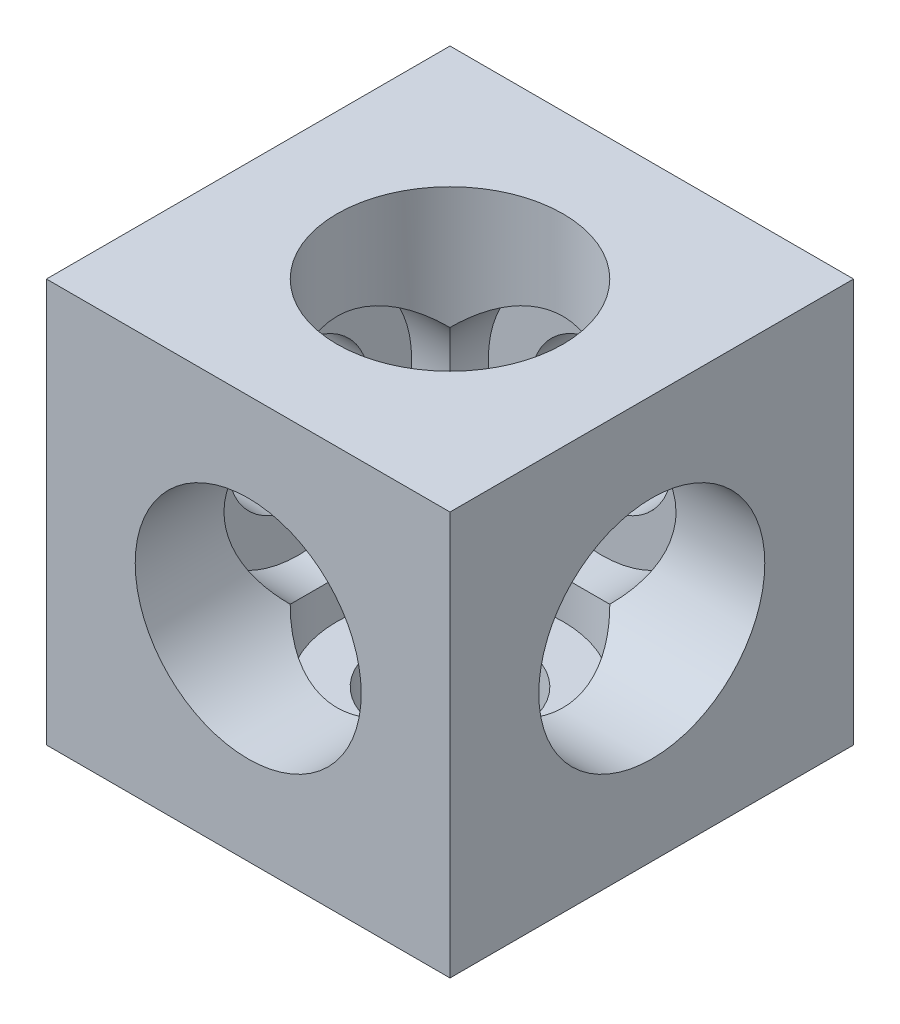
ISO-10303-21;
HEADER;
FILE_DESCRIPTION(('STEP AP214'),'2;1');
FILE_NAME('part.step','',(''),(''),'','','');
FILE_SCHEMA(('AUTOMOTIVE_DESIGN { 1 0 10303 214 1 1 1 1 }'));
ENDSEC;
DATA;
#1=APPLICATION_CONTEXT('core data for automotive mechanical design processes');
#2=APPLICATION_PROTOCOL_DEFINITION('international standard','automotive_design',2000,#1);
#3=PRODUCT_CONTEXT('',#1,'mechanical');
#4=PRODUCT('Part','Part','',(#3));
#5=PRODUCT_RELATED_PRODUCT_CATEGORY('part','',(#4));
#6=PRODUCT_DEFINITION_FORMATION('','',#4);
#7=PRODUCT_DEFINITION_CONTEXT('part definition',#1,'design');
#8=PRODUCT_DEFINITION('design','',#6,#7);
#9=PRODUCT_DEFINITION_SHAPE('','',#8);
#10=(LENGTH_UNIT() NAMED_UNIT(*) SI_UNIT(.MILLI.,.METRE.));
#11=(NAMED_UNIT(*) PLANE_ANGLE_UNIT() SI_UNIT($,.RADIAN.));
#12=(NAMED_UNIT(*) SI_UNIT($,.STERADIAN.) SOLID_ANGLE_UNIT());
#13=UNCERTAINTY_MEASURE_WITH_UNIT(LENGTH_MEASURE(1.E-05),#10,'distance_accuracy_value','');
#14=(GEOMETRIC_REPRESENTATION_CONTEXT(3) GLOBAL_UNCERTAINTY_ASSIGNED_CONTEXT((#13)) GLOBAL_UNIT_ASSIGNED_CONTEXT((#10,
#11,#12)) REPRESENTATION_CONTEXT('',''));
#15=CARTESIAN_POINT('',(0.,0.,0.));
#16=DIRECTION('',(0.,0.,1.));
#17=DIRECTION('',(1.,0.,0.));
#18=AXIS2_PLACEMENT_3D('',#15,#16,#17);
#19=CARTESIAN_POINT('',(-10.,0.,0.));
#20=DIRECTION('',(1.,0.,0.));
#21=DIRECTION('',(0.,0.,-1.));
#22=AXIS2_PLACEMENT_3D('',#19,#20,#21);
#23=CYLINDRICAL_SURFACE('',#22,3.5);
#24=CARTESIAN_POINT('',(-10.,0.,0.));
#25=DIRECTION('',(1.,0.,0.));
#26=DIRECTION('',(0.,0.,-1.));
#27=AXIS2_PLACEMENT_3D('',#24,#25,#26);
#28=CIRCLE('',#27,3.5);
#29=CARTESIAN_POINT('',(-10.,0.,-3.5));
#30=VERTEX_POINT('',#29);
#31=EDGE_CURVE('E146',#30,#30,#28,.T.);
#32=ORIENTED_EDGE('',*,*,#31,.F.);
#33=EDGE_LOOP('',(#32));
#34=FACE_BOUND('',#33,.T.);
#35=CARTESIAN_POINT('',(-7.5,0.,0.));
#36=DIRECTION('',(1.,0.,0.));
#37=DIRECTION('',(0.,0.,-1.));
#38=AXIS2_PLACEMENT_3D('',#35,#36,#37);
#39=CIRCLE('',#38,3.5);
#40=CARTESIAN_POINT('',(-7.5,0.,-3.5));
#41=VERTEX_POINT('',#40);
#42=EDGE_CURVE('E39',#41,#41,#39,.F.);
#43=ORIENTED_EDGE('',*,*,#42,.F.);
#44=EDGE_LOOP('',(#43));
#45=FACE_BOUND('',#44,.T.);
#46=ADVANCED_FACE('F35',(#34,#45),#23,.F.);
#47=CARTESIAN_POINT('',(0.,0.,-10.));
#48=DIRECTION('',(0.,0.,1.));
#49=DIRECTION('',(1.,0.,0.));
#50=AXIS2_PLACEMENT_3D('',#47,#48,#49);
#51=CYLINDRICAL_SURFACE('',#50,3.5);
#52=CARTESIAN_POINT('',(0.,0.,-10.));
#53=DIRECTION('',(0.,0.,1.));
#54=DIRECTION('',(1.,0.,0.));
#55=AXIS2_PLACEMENT_3D('',#52,#53,#54);
#56=CIRCLE('',#55,3.5);
#57=CARTESIAN_POINT('',(3.5,0.,-10.));
#58=VERTEX_POINT('',#57);
#59=EDGE_CURVE('E149',#58,#58,#56,.T.);
#60=ORIENTED_EDGE('',*,*,#59,.F.);
#61=EDGE_LOOP('',(#60));
#62=FACE_BOUND('',#61,.T.);
#63=CARTESIAN_POINT('',(0.,0.,-7.5));
#64=DIRECTION('',(0.,0.,1.));
#65=DIRECTION('',(1.,0.,0.));
#66=AXIS2_PLACEMENT_3D('',#63,#64,#65);
#67=CIRCLE('',#66,3.5);
#68=CARTESIAN_POINT('',(3.5,0.,-7.5));
#69=VERTEX_POINT('',#68);
#70=EDGE_CURVE('E123',#69,#69,#67,.F.);
#71=ORIENTED_EDGE('',*,*,#70,.F.);
#72=EDGE_LOOP('',(#71));
#73=FACE_BOUND('',#72,.T.);
#74=ADVANCED_FACE('F224',(#62,#73),#51,.F.);
#75=CARTESIAN_POINT('',(0.,-7.5,0.));
#76=DIRECTION('',(0.,1.,0.));
#77=DIRECTION('',(-1.,0.,0.));
#78=AXIS2_PLACEMENT_3D('',#75,#76,#77);
#79=CYLINDRICAL_SURFACE('',#78,5.6);
#80=CARTESIAN_POINT('',(0.,10.,0.));
#81=DIRECTION('',(0.,1.,0.));
#82=DIRECTION('',(-1.,0.,0.));
#83=AXIS2_PLACEMENT_3D('',#80,#81,#82);
#84=CIRCLE('',#83,5.6);
#85=CARTESIAN_POINT('',(-5.6,10.,0.));
#86=VERTEX_POINT('',#85);
#87=EDGE_CURVE('E125',#86,#86,#84,.T.);
#88=ORIENTED_EDGE('',*,*,#87,.T.);
#89=EDGE_LOOP('',(#88));
#90=FACE_BOUND('',#89,.T.);
#91=CARTESIAN_POINT('',(0.,0.,0.));
#92=DIRECTION('',(0.,0.707106781186547,-0.707106781186547));
#93=DIRECTION('',(0.,0.707106781186547,0.707106781186547));
#94=AXIS2_PLACEMENT_3D('',#91,#92,#93);
#95=ELLIPSE('',#94,7.91959594928933,5.6);
#96=CARTESIAN_POINT('',(3.95979797464466,3.95979797464467,3.95979797464467));
#97=VERTEX_POINT('',#96);
#98=CARTESIAN_POINT('',(-3.95979797464467,3.95979797464467,3.95979797464467));
#99=VERTEX_POINT('',#98);
#100=EDGE_CURVE('E112',#97,#99,#95,.F.);
#101=ORIENTED_EDGE('',*,*,#100,.T.);
#102=CARTESIAN_POINT('',(0.,0.,0.));
#103=DIRECTION('',(0.707106781186547,0.707106781186548,0.));
#104=DIRECTION('',(-0.707106781186547,0.707106781186547,0.));
#105=AXIS2_PLACEMENT_3D('',#102,#103,#104);
#106=ELLIPSE('',#105,7.91959594928933,5.6);
#107=CARTESIAN_POINT('',(-3.95979797464466,3.95979797464466,-3.95979797464467));
#108=VERTEX_POINT('',#107);
#109=EDGE_CURVE('E99',#99,#108,#106,.F.);
#110=ORIENTED_EDGE('',*,*,#109,.T.);
#111=CARTESIAN_POINT('',(0.,0.,0.));
#112=DIRECTION('',(0.,0.707106781186547,0.707106781186547));
#113=DIRECTION('',(0.,0.707106781186547,-0.707106781186547));
#114=AXIS2_PLACEMENT_3D('',#111,#112,#113);
#115=ELLIPSE('',#114,7.91959594928933,5.6);
#116=CARTESIAN_POINT('',(3.95979797464466,3.95979797464466,-3.95979797464467));
#117=VERTEX_POINT('',#116);
#118=EDGE_CURVE('E105',#108,#117,#115,.F.);
#119=ORIENTED_EDGE('',*,*,#118,.T.);
#120=CARTESIAN_POINT('',(0.,0.,0.));
#121=DIRECTION('',(-0.707106781186547,0.707106781186547,0.));
#122=DIRECTION('',(0.707106781186547,0.707106781186548,0.));
#123=AXIS2_PLACEMENT_3D('',#120,#121,#122);
#124=ELLIPSE('',#123,7.91959594928933,5.6);
#125=EDGE_CURVE('E51',#117,#97,#124,.F.);
#126=ORIENTED_EDGE('',*,*,#125,.T.);
#127=EDGE_LOOP('',(#101,#110,#119,#126));
#128=FACE_BOUND('',#127,.T.);
#129=ADVANCED_FACE('F110',(#90,#128),#79,.F.);
#130=CARTESIAN_POINT('',(0.,-10.,0.));
#131=DIRECTION('',(0.,1.,0.));
#132=DIRECTION('',(-1.,0.,0.));
#133=AXIS2_PLACEMENT_3D('',#130,#131,#132);
#134=CYLINDRICAL_SURFACE('',#133,3.5);
#135=CARTESIAN_POINT('',(0.,-10.,0.));
#136=DIRECTION('',(0.,1.,0.));
#137=DIRECTION('',(-1.,0.,0.));
#138=AXIS2_PLACEMENT_3D('',#135,#136,#137);
#139=CIRCLE('',#138,3.5);
#140=CARTESIAN_POINT('',(-3.5,-10.,0.));
#141=VERTEX_POINT('',#140);
#142=EDGE_CURVE('E152',#141,#141,#139,.T.);
#143=ORIENTED_EDGE('',*,*,#142,.F.);
#144=EDGE_LOOP('',(#143));
#145=FACE_BOUND('',#144,.T.);
#146=CARTESIAN_POINT('',(0.,-7.5,0.));
#147=DIRECTION('',(0.,1.,0.));
#148=DIRECTION('',(-1.,0.,0.));
#149=AXIS2_PLACEMENT_3D('',#146,#147,#148);
#150=CIRCLE('',#149,3.5);
#151=CARTESIAN_POINT('',(-3.5,-7.5,0.));
#152=VERTEX_POINT('',#151);
#153=EDGE_CURVE('E144',#152,#152,#150,.F.);
#154=ORIENTED_EDGE('',*,*,#153,.F.);
#155=EDGE_LOOP('',(#154));
#156=FACE_BOUND('',#155,.T.);
#157=ADVANCED_FACE('F237',(#145,#156),#134,.F.);
#158=CARTESIAN_POINT('',(-10.,-10.,10.));
#159=DIRECTION('',(1.,0.,0.));
#160=DIRECTION('',(0.,0.,-1.));
#161=AXIS2_PLACEMENT_3D('',#158,#159,#160);
#162=PLANE('',#161);
#163=ORIENTED_EDGE('',*,*,#31,.T.);
#164=EDGE_LOOP('',(#163));
#165=FACE_BOUND('',#164,.T.);
#166=DIRECTION('',(0.,-1.,0.));
#167=VECTOR('',#166,1.);
#168=CARTESIAN_POINT('',(-10.,-10.,-10.));
#169=LINE('',#168,#167);
#170=CARTESIAN_POINT('',(-10.,10.,-10.));
#171=VERTEX_POINT('',#170);
#172=CARTESIAN_POINT('',(-10.,-10.,-10.));
#173=VERTEX_POINT('',#172);
#174=EDGE_CURVE('E155',#171,#173,#169,.T.);
#175=ORIENTED_EDGE('',*,*,#174,.T.);
#176=DIRECTION('',(0.,0.,-1.));
#177=VECTOR('',#176,1.);
#178=CARTESIAN_POINT('',(-10.,-10.,10.));
#179=LINE('',#178,#177);
#180=CARTESIAN_POINT('',(-10.,-10.,10.));
#181=VERTEX_POINT('',#180);
#182=EDGE_CURVE('E182',#181,#173,#179,.T.);
#183=ORIENTED_EDGE('',*,*,#182,.F.);
#184=DIRECTION('',(0.,-1.,0.));
#185=VECTOR('',#184,1.);
#186=CARTESIAN_POINT('',(-10.,-10.,10.));
#187=LINE('',#186,#185);
#188=CARTESIAN_POINT('',(-10.,10.,10.));
#189=VERTEX_POINT('',#188);
#190=EDGE_CURVE('E156',#189,#181,#187,.T.);
#191=ORIENTED_EDGE('',*,*,#190,.F.);
#192=DIRECTION('',(0.,0.,-1.));
#193=VECTOR('',#192,1.);
#194=CARTESIAN_POINT('',(-10.,10.,10.));
#195=LINE('',#194,#193);
#196=EDGE_CURVE('E166',#189,#171,#195,.T.);
#197=ORIENTED_EDGE('',*,*,#196,.T.);
#198=EDGE_LOOP('',(#175,#183,#191,#197));
#199=FACE_BOUND('',#198,.T.);
#200=ADVANCED_FACE('F37',(#165,#199),#162,.F.);
#201=CARTESIAN_POINT('',(10.,-9.99999999999999,10.));
#202=DIRECTION('',(0.,1.,0.));
#203=DIRECTION('',(-1.,0.,0.));
#204=AXIS2_PLACEMENT_3D('',#201,#202,#203);
#205=PLANE('',#204);
#206=ORIENTED_EDGE('',*,*,#142,.T.);
#207=EDGE_LOOP('',(#206));
#208=FACE_BOUND('',#207,.T.);
#209=DIRECTION('',(1.,0.,0.));
#210=VECTOR('',#209,1.);
#211=CARTESIAN_POINT('',(10.,-9.99999999999999,-10.));
#212=LINE('',#211,#210);
#213=CARTESIAN_POINT('',(10.,-9.99999999999999,-10.));
#214=VERTEX_POINT('',#213);
#215=EDGE_CURVE('E169',#173,#214,#212,.T.);
#216=ORIENTED_EDGE('',*,*,#215,.T.);
#217=DIRECTION('',(0.,0.,-1.));
#218=VECTOR('',#217,1.);
#219=CARTESIAN_POINT('',(10.,-9.99999999999999,10.));
#220=LINE('',#219,#218);
#221=CARTESIAN_POINT('',(10.,-9.99999999999999,10.));
#222=VERTEX_POINT('',#221);
#223=EDGE_CURVE('E179',#222,#214,#220,.T.);
#224=ORIENTED_EDGE('',*,*,#223,.F.);
#225=DIRECTION('',(1.,0.,0.));
#226=VECTOR('',#225,1.);
#227=CARTESIAN_POINT('',(10.,-9.99999999999999,10.));
#228=LINE('',#227,#226);
#229=EDGE_CURVE('E159',#181,#222,#228,.T.);
#230=ORIENTED_EDGE('',*,*,#229,.F.);
#231=ORIENTED_EDGE('',*,*,#182,.T.);
#232=EDGE_LOOP('',(#216,#224,#230,#231));
#233=FACE_BOUND('',#232,.T.);
#234=ADVANCED_FACE('F256',(#208,#233),#205,.F.);
#235=CARTESIAN_POINT('',(10.,-9.99999999999999,10.));
#236=DIRECTION('',(-1.,0.,0.));
#237=DIRECTION('',(0.,0.,1.));
#238=AXIS2_PLACEMENT_3D('',#235,#236,#237);
#239=PLANE('',#238);
#240=CARTESIAN_POINT('',(10.,0.,0.));
#241=DIRECTION('',(1.,0.,0.));
#242=DIRECTION('',(0.,0.,-1.));
#243=AXIS2_PLACEMENT_3D('',#240,#241,#242);
#244=CIRCLE('',#243,5.6);
#245=CARTESIAN_POINT('',(10.,0.,-5.6));
#246=VERTEX_POINT('',#245);
#247=EDGE_CURVE('E199',#246,#246,#244,.T.);
#248=ORIENTED_EDGE('',*,*,#247,.F.);
#249=EDGE_LOOP('',(#248));
#250=FACE_BOUND('',#249,.T.);
#251=DIRECTION('',(0.,1.,0.));
#252=VECTOR('',#251,1.);
#253=CARTESIAN_POINT('',(10.,-9.99999999999999,-10.));
#254=LINE('',#253,#252);
#255=CARTESIAN_POINT('',(10.,10.,-10.));
#256=VERTEX_POINT('',#255);
#257=EDGE_CURVE('E171',#214,#256,#254,.T.);
#258=ORIENTED_EDGE('',*,*,#257,.T.);
#259=DIRECTION('',(0.,0.,-1.));
#260=VECTOR('',#259,1.);
#261=CARTESIAN_POINT('',(10.,10.,10.));
#262=LINE('',#261,#260);
#263=CARTESIAN_POINT('',(10.,10.,10.));
#264=VERTEX_POINT('',#263);
#265=EDGE_CURVE('E176',#264,#256,#262,.T.);
#266=ORIENTED_EDGE('',*,*,#265,.F.);
#267=DIRECTION('',(0.,1.,0.));
#268=VECTOR('',#267,1.);
#269=CARTESIAN_POINT('',(10.,-9.99999999999999,10.));
#270=LINE('',#269,#268);
#271=EDGE_CURVE('E162',#222,#264,#270,.T.);
#272=ORIENTED_EDGE('',*,*,#271,.F.);
#273=ORIENTED_EDGE('',*,*,#223,.T.);
#274=EDGE_LOOP('',(#258,#266,#272,#273));
#275=FACE_BOUND('',#274,.T.);
#276=ADVANCED_FACE('F253',(#250,#275),#239,.F.);
#277=CARTESIAN_POINT('',(10.,10.,10.));
#278=DIRECTION('',(0.,-1.,0.));
#279=DIRECTION('',(1.,0.,0.));
#280=AXIS2_PLACEMENT_3D('',#277,#278,#279);
#281=PLANE('',#280);
#282=ORIENTED_EDGE('',*,*,#87,.F.);
#283=EDGE_LOOP('',(#282));
#284=FACE_BOUND('',#283,.T.);
#285=DIRECTION('',(-1.,0.,0.));
#286=VECTOR('',#285,1.);
#287=CARTESIAN_POINT('',(10.,10.,-10.));
#288=LINE('',#287,#286);
#289=EDGE_CURVE('E160',#256,#171,#288,.T.);
#290=ORIENTED_EDGE('',*,*,#289,.T.);
#291=ORIENTED_EDGE('',*,*,#196,.F.);
#292=DIRECTION('',(-1.,0.,0.));
#293=VECTOR('',#292,1.);
#294=CARTESIAN_POINT('',(10.,10.,10.));
#295=LINE('',#294,#293);
#296=EDGE_CURVE('E164',#264,#189,#295,.T.);
#297=ORIENTED_EDGE('',*,*,#296,.F.);
#298=ORIENTED_EDGE('',*,*,#265,.T.);
#299=EDGE_LOOP('',(#290,#291,#297,#298));
#300=FACE_BOUND('',#299,.T.);
#301=ADVANCED_FACE('F245',(#284,#300),#281,.F.);
#302=CARTESIAN_POINT('',(0.,0.,10.));
#303=DIRECTION('',(0.,0.,1.));
#304=DIRECTION('',(1.,0.,0.));
#305=AXIS2_PLACEMENT_3D('',#302,#303,#304);
#306=PLANE('',#305);
#307=CARTESIAN_POINT('',(0.,0.,10.));
#308=DIRECTION('',(0.,0.,1.));
#309=DIRECTION('',(1.,0.,0.));
#310=AXIS2_PLACEMENT_3D('',#307,#308,#309);
#311=CIRCLE('',#310,5.6);
#312=CARTESIAN_POINT('',(5.6,0.,10.));
#313=VERTEX_POINT('',#312);
#314=EDGE_CURVE('E133',#313,#313,#311,.T.);
#315=ORIENTED_EDGE('',*,*,#314,.F.);
#316=EDGE_LOOP('',(#315));
#317=FACE_BOUND('',#316,.T.);
#318=ORIENTED_EDGE('',*,*,#190,.T.);
#319=ORIENTED_EDGE('',*,*,#229,.T.);
#320=ORIENTED_EDGE('',*,*,#271,.T.);
#321=ORIENTED_EDGE('',*,*,#296,.T.);
#322=EDGE_LOOP('',(#318,#319,#320,#321));
#323=FACE_BOUND('',#322,.T.);
#324=ADVANCED_FACE('F241',(#317,#323),#306,.T.);
#325=CARTESIAN_POINT('',(0.,0.,-10.));
#326=DIRECTION('',(0.,0.,1.));
#327=DIRECTION('',(1.,0.,0.));
#328=AXIS2_PLACEMENT_3D('',#325,#326,#327);
#329=PLANE('',#328);
#330=ORIENTED_EDGE('',*,*,#59,.T.);
#331=EDGE_LOOP('',(#330));
#332=FACE_BOUND('',#331,.T.);
#333=ORIENTED_EDGE('',*,*,#174,.F.);
#334=ORIENTED_EDGE('',*,*,#289,.F.);
#335=ORIENTED_EDGE('',*,*,#257,.F.);
#336=ORIENTED_EDGE('',*,*,#215,.F.);
#337=EDGE_LOOP('',(#333,#334,#335,#336));
#338=FACE_BOUND('',#337,.T.);
#339=ADVANCED_FACE('F244',(#332,#338),#329,.F.);
#340=CARTESIAN_POINT('',(0.,-7.5,0.));
#341=DIRECTION('',(0.,1.,0.));
#342=DIRECTION('',(-1.,0.,0.));
#343=AXIS2_PLACEMENT_3D('',#340,#341,#342);
#344=PLANE('',#343);
#345=CARTESIAN_POINT('',(0.,-7.5,0.));
#346=DIRECTION('',(0.,1.,0.));
#347=DIRECTION('',(-1.,0.,0.));
#348=AXIS2_PLACEMENT_3D('',#345,#346,#347);
#349=CIRCLE('',#348,5.6);
#350=CARTESIAN_POINT('',(-5.6,-7.5,0.));
#351=VERTEX_POINT('',#350);
#352=EDGE_CURVE('E130',#351,#351,#349,.T.);
#353=ORIENTED_EDGE('',*,*,#352,.T.);
#354=EDGE_LOOP('',(#353));
#355=FACE_BOUND('',#354,.T.);
#356=ORIENTED_EDGE('',*,*,#153,.T.);
#357=EDGE_LOOP('',(#356));
#358=FACE_BOUND('',#357,.T.);
#359=ADVANCED_FACE('F249',(#355,#358),#344,.T.);
#360=CARTESIAN_POINT('',(0.,0.,0.));
#361=DIRECTION('',(0.,0.707106781186547,0.707106781186547));
#362=DIRECTION('',(0.,0.707106781186547,-0.707106781186547));
#363=AXIS2_PLACEMENT_3D('',#360,#361,#362);
#364=ELLIPSE('',#363,7.91959594928933,5.6);
#365=CARTESIAN_POINT('',(-3.95979797464466,-3.95979797464467,3.95979797464467));
#366=VERTEX_POINT('',#365);
#367=CARTESIAN_POINT('',(3.95979797464467,-3.95979797464467,3.95979797464467));
#368=VERTEX_POINT('',#367);
#369=EDGE_CURVE('E116',#366,#368,#364,.T.);
#370=ORIENTED_EDGE('',*,*,#369,.T.);
#371=CARTESIAN_POINT('',(0.,0.,0.));
#372=DIRECTION('',(0.707106781186547,0.707106781186548,0.));
#373=DIRECTION('',(-0.707106781186547,0.707106781186547,0.));
#374=AXIS2_PLACEMENT_3D('',#371,#372,#373);
#375=ELLIPSE('',#374,7.91959594928933,5.6);
#376=CARTESIAN_POINT('',(3.95979797464466,-3.95979797464466,-3.95979797464467));
#377=VERTEX_POINT('',#376);
#378=EDGE_CURVE('E192',#368,#377,#375,.T.);
#379=ORIENTED_EDGE('',*,*,#378,.T.);
#380=CARTESIAN_POINT('',(0.,0.,0.));
#381=DIRECTION('',(0.,0.707106781186547,-0.707106781186547));
#382=DIRECTION('',(0.,0.707106781186547,0.707106781186547));
#383=AXIS2_PLACEMENT_3D('',#380,#381,#382);
#384=ELLIPSE('',#383,7.91959594928933,5.6);
#385=CARTESIAN_POINT('',(-3.95979797464466,-3.95979797464466,-3.95979797464467));
#386=VERTEX_POINT('',#385);
#387=EDGE_CURVE('E119',#377,#386,#384,.T.);
#388=ORIENTED_EDGE('',*,*,#387,.T.);
#389=CARTESIAN_POINT('',(0.,0.,0.));
#390=DIRECTION('',(-0.707106781186547,0.707106781186547,0.));
#391=DIRECTION('',(0.707106781186547,0.707106781186548,0.));
#392=AXIS2_PLACEMENT_3D('',#389,#390,#391);
#393=ELLIPSE('',#392,7.91959594928933,5.6);
#394=EDGE_CURVE('E58',#386,#366,#393,.T.);
#395=ORIENTED_EDGE('',*,*,#394,.T.);
#396=EDGE_LOOP('',(#370,#379,#388,#395));
#397=FACE_BOUND('',#396,.T.);
#398=ORIENTED_EDGE('',*,*,#352,.F.);
#399=EDGE_LOOP('',(#398));
#400=FACE_BOUND('',#399,.T.);
#401=ADVANCED_FACE('F189',(#397,#400),#79,.F.);
#402=CARTESIAN_POINT('',(0.,0.,-7.5));
#403=DIRECTION('',(0.,0.,1.));
#404=DIRECTION('',(1.,0.,0.));
#405=AXIS2_PLACEMENT_3D('',#402,#403,#404);
#406=CYLINDRICAL_SURFACE('',#405,5.6);
#407=ORIENTED_EDGE('',*,*,#314,.T.);
#408=EDGE_LOOP('',(#407));
#409=FACE_BOUND('',#408,.T.);
#410=ORIENTED_EDGE('',*,*,#369,.F.);
#411=CARTESIAN_POINT('',(0.,0.,0.));
#412=DIRECTION('',(0.707106781186547,0.,0.707106781186547));
#413=DIRECTION('',(-0.707106781186547,0.,0.707106781186547));
#414=AXIS2_PLACEMENT_3D('',#411,#412,#413);
#415=ELLIPSE('',#414,7.91959594928933,5.6);
#416=EDGE_CURVE('E113',#366,#99,#415,.F.);
#417=ORIENTED_EDGE('',*,*,#416,.T.);
#418=ORIENTED_EDGE('',*,*,#100,.F.);
#419=CARTESIAN_POINT('',(0.,0.,0.));
#420=DIRECTION('',(-0.707106781186547,0.,0.707106781186547));
#421=DIRECTION('',(0.707106781186547,0.,0.707106781186547));
#422=AXIS2_PLACEMENT_3D('',#419,#420,#421);
#423=ELLIPSE('',#422,7.91959594928933,5.6);
#424=EDGE_CURVE('E140',#97,#368,#423,.F.);
#425=ORIENTED_EDGE('',*,*,#424,.T.);
#426=EDGE_LOOP('',(#410,#417,#418,#425));
#427=FACE_BOUND('',#426,.T.);
#428=ADVANCED_FACE('F219',(#409,#427),#406,.F.);
#429=CARTESIAN_POINT('',(0.,0.,-7.5));
#430=DIRECTION('',(0.,0.,1.));
#431=DIRECTION('',(1.,0.,0.));
#432=AXIS2_PLACEMENT_3D('',#429,#430,#431);
#433=PLANE('',#432);
#434=CARTESIAN_POINT('',(0.,0.,-7.5));
#435=DIRECTION('',(0.,0.,1.));
#436=DIRECTION('',(1.,0.,0.));
#437=AXIS2_PLACEMENT_3D('',#434,#435,#436);
#438=CIRCLE('',#437,5.6);
#439=CARTESIAN_POINT('',(5.6,0.,-7.5));
#440=VERTEX_POINT('',#439);
#441=EDGE_CURVE('E126',#440,#440,#438,.T.);
#442=ORIENTED_EDGE('',*,*,#441,.T.);
#443=EDGE_LOOP('',(#442));
#444=FACE_BOUND('',#443,.T.);
#445=ORIENTED_EDGE('',*,*,#70,.T.);
#446=EDGE_LOOP('',(#445));
#447=FACE_BOUND('',#446,.T.);
#448=ADVANCED_FACE('F216',(#444,#447),#433,.T.);
#449=ORIENTED_EDGE('',*,*,#441,.F.);
#450=EDGE_LOOP('',(#449));
#451=FACE_BOUND('',#450,.T.);
#452=ORIENTED_EDGE('',*,*,#387,.F.);
#453=CARTESIAN_POINT('',(0.,0.,0.));
#454=DIRECTION('',(0.707106781186547,0.,0.707106781186547));
#455=DIRECTION('',(-0.707106781186547,0.,0.707106781186547));
#456=AXIS2_PLACEMENT_3D('',#453,#454,#455);
#457=ELLIPSE('',#456,7.91959594928933,5.6);
#458=EDGE_CURVE('E11',#377,#117,#457,.T.);
#459=ORIENTED_EDGE('',*,*,#458,.T.);
#460=ORIENTED_EDGE('',*,*,#118,.F.);
#461=CARTESIAN_POINT('',(0.,0.,0.));
#462=DIRECTION('',(-0.707106781186547,0.,0.707106781186547));
#463=DIRECTION('',(0.707106781186547,0.,0.707106781186547));
#464=AXIS2_PLACEMENT_3D('',#461,#462,#463);
#465=ELLIPSE('',#464,7.91959594928933,5.6);
#466=EDGE_CURVE('E44',#108,#386,#465,.T.);
#467=ORIENTED_EDGE('',*,*,#466,.T.);
#468=EDGE_LOOP('',(#452,#459,#460,#467));
#469=FACE_BOUND('',#468,.T.);
#470=ADVANCED_FACE('F115',(#451,#469),#406,.F.);
#471=CARTESIAN_POINT('',(-7.5,0.,0.));
#472=DIRECTION('',(1.,0.,0.));
#473=DIRECTION('',(0.,0.,-1.));
#474=AXIS2_PLACEMENT_3D('',#471,#472,#473);
#475=CYLINDRICAL_SURFACE('',#474,5.6);
#476=CARTESIAN_POINT('',(-7.5,0.,0.));
#477=DIRECTION('',(1.,0.,0.));
#478=DIRECTION('',(0.,0.,-1.));
#479=AXIS2_PLACEMENT_3D('',#476,#477,#478);
#480=CIRCLE('',#479,5.6);
#481=CARTESIAN_POINT('',(-7.5,0.,-5.6));
#482=VERTEX_POINT('',#481);
#483=EDGE_CURVE('E198',#482,#482,#480,.T.);
#484=ORIENTED_EDGE('',*,*,#483,.F.);
#485=EDGE_LOOP('',(#484));
#486=FACE_BOUND('',#485,.T.);
#487=ORIENTED_EDGE('',*,*,#394,.F.);
#488=ORIENTED_EDGE('',*,*,#466,.F.);
#489=ORIENTED_EDGE('',*,*,#109,.F.);
#490=ORIENTED_EDGE('',*,*,#416,.F.);
#491=EDGE_LOOP('',(#487,#488,#489,#490));
#492=FACE_BOUND('',#491,.T.);
#493=ADVANCED_FACE('F98',(#486,#492),#475,.F.);
#494=CARTESIAN_POINT('',(-7.5,0.,0.));
#495=DIRECTION('',(1.,0.,0.));
#496=DIRECTION('',(0.,0.,-1.));
#497=AXIS2_PLACEMENT_3D('',#494,#495,#496);
#498=PLANE('',#497);
#499=ORIENTED_EDGE('',*,*,#483,.T.);
#500=EDGE_LOOP('',(#499));
#501=FACE_BOUND('',#500,.T.);
#502=ORIENTED_EDGE('',*,*,#42,.T.);
#503=EDGE_LOOP('',(#502));
#504=FACE_BOUND('',#503,.T.);
#505=ADVANCED_FACE('F205',(#501,#504),#498,.T.);
#506=ORIENTED_EDGE('',*,*,#247,.T.);
#507=EDGE_LOOP('',(#506));
#508=FACE_BOUND('',#507,.T.);
#509=ORIENTED_EDGE('',*,*,#125,.F.);
#510=ORIENTED_EDGE('',*,*,#458,.F.);
#511=ORIENTED_EDGE('',*,*,#378,.F.);
#512=ORIENTED_EDGE('',*,*,#424,.F.);
#513=EDGE_LOOP('',(#509,#510,#511,#512));
#514=FACE_BOUND('',#513,.T.);
#515=ADVANCED_FACE('F210',(#508,#514),#475,.F.);
#516=CLOSED_SHELL('',(#46,#74,#129,#157,#200,#234,#276,#301,#324,#339,#359,#401,#428,#448,#470,
#493,#505,#515));
#517=MANIFOLD_SOLID_BREP('B2',#516);
#518=ADVANCED_BREP_SHAPE_REPRESENTATION('',(#18,#517),#14);
#519=SHAPE_DEFINITION_REPRESENTATION(#9,#518);
ENDSEC;
END-ISO-10303-21;
